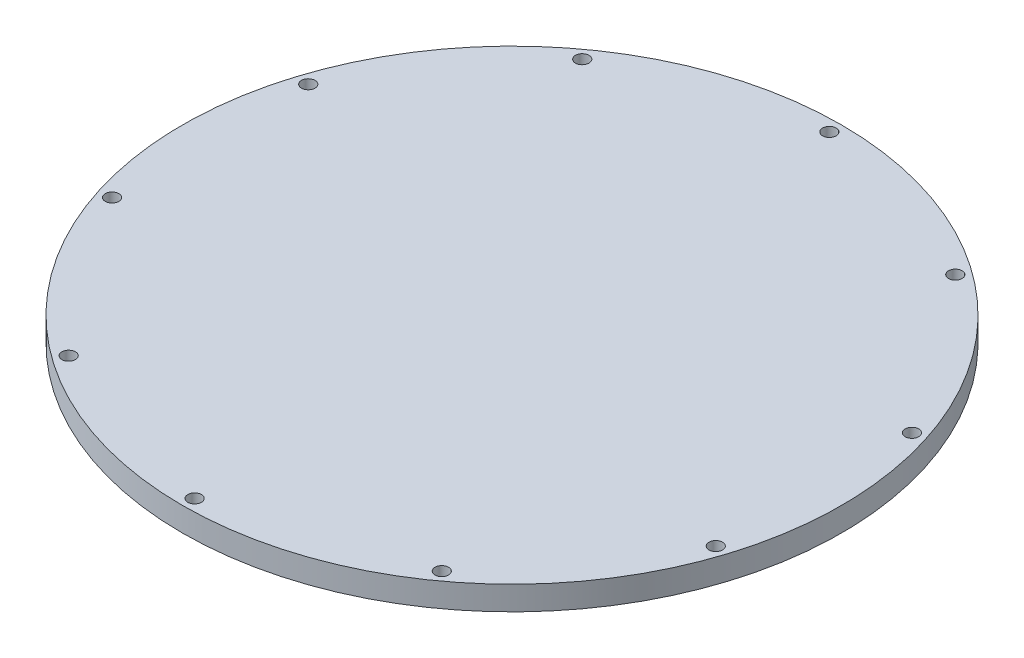
ISO-10303-21;
HEADER;
FILE_DESCRIPTION(('STEP AP214'),'2;1');
FILE_NAME('part.step','',(''),(''),'','','');
FILE_SCHEMA(('AUTOMOTIVE_DESIGN { 1 0 10303 214 1 1 1 1 }'));
ENDSEC;
DATA;
#1=APPLICATION_CONTEXT('core data for automotive mechanical design processes');
#2=APPLICATION_PROTOCOL_DEFINITION('international standard','automotive_design',2000,#1);
#3=PRODUCT_CONTEXT('',#1,'mechanical');
#4=PRODUCT('Part','Part','',(#3));
#5=PRODUCT_RELATED_PRODUCT_CATEGORY('part','',(#4));
#6=PRODUCT_DEFINITION_FORMATION('','',#4);
#7=PRODUCT_DEFINITION_CONTEXT('part definition',#1,'design');
#8=PRODUCT_DEFINITION('design','',#6,#7);
#9=PRODUCT_DEFINITION_SHAPE('','',#8);
#10=(LENGTH_UNIT() NAMED_UNIT(*) SI_UNIT(.MILLI.,.METRE.));
#11=(NAMED_UNIT(*) PLANE_ANGLE_UNIT() SI_UNIT($,.RADIAN.));
#12=(NAMED_UNIT(*) SI_UNIT($,.STERADIAN.) SOLID_ANGLE_UNIT());
#13=UNCERTAINTY_MEASURE_WITH_UNIT(LENGTH_MEASURE(1.E-05),#10,'distance_accuracy_value','');
#14=(GEOMETRIC_REPRESENTATION_CONTEXT(3) GLOBAL_UNCERTAINTY_ASSIGNED_CONTEXT((#13)) GLOBAL_UNIT_ASSIGNED_CONTEXT((#10,
#11,#12)) REPRESENTATION_CONTEXT('',''));
#15=CARTESIAN_POINT('',(0.,0.,0.));
#16=DIRECTION('',(0.,0.,1.));
#17=DIRECTION('',(1.,0.,0.));
#18=AXIS2_PLACEMENT_3D('',#15,#16,#17);
#19=CARTESIAN_POINT('',(0.,3.,0.));
#20=DIRECTION('',(0.,-1.,0.));
#21=DIRECTION('',(0.,0.,-1.));
#22=AXIS2_PLACEMENT_3D('',#19,#20,#21);
#23=CYLINDRICAL_SURFACE('',#22,82.55);
#24=CARTESIAN_POINT('',(0.,3.,0.));
#25=DIRECTION('',(0.,1.,0.));
#26=DIRECTION('',(0.,0.,1.));
#27=AXIS2_PLACEMENT_3D('',#24,#25,#26);
#28=CIRCLE('',#27,82.55);
#29=CARTESIAN_POINT('',(0.,3.,82.55));
#30=VERTEX_POINT('',#29);
#31=EDGE_CURVE('E10',#30,#30,#28,.T.);
#32=ORIENTED_EDGE('',*,*,#31,.F.);
#33=EDGE_LOOP('',(#32));
#34=FACE_BOUND('',#33,.T.);
#35=CARTESIAN_POINT('',(0.,-3.,0.));
#36=DIRECTION('',(0.,1.,0.));
#37=DIRECTION('',(0.,0.,1.));
#38=AXIS2_PLACEMENT_3D('',#35,#36,#37);
#39=CIRCLE('',#38,82.55);
#40=CARTESIAN_POINT('',(0.,-3.,82.55));
#41=VERTEX_POINT('',#40);
#42=EDGE_CURVE('E34',#41,#41,#39,.T.);
#43=ORIENTED_EDGE('',*,*,#42,.T.);
#44=EDGE_LOOP('',(#43));
#45=FACE_BOUND('',#44,.T.);
#46=ADVANCED_FACE('F31',(#34,#45),#23,.T.);
#47=CARTESIAN_POINT('',(0.,3.,0.));
#48=DIRECTION('',(0.,1.,0.));
#49=DIRECTION('',(0.,0.,1.));
#50=AXIS2_PLACEMENT_3D('',#47,#48,#49);
#51=PLANE('',#50);
#52=CARTESIAN_POINT('',(0.,3.,-79.5));
#53=DIRECTION('',(0.,1.,0.));
#54=DIRECTION('',(0.,0.,1.));
#55=AXIS2_PLACEMENT_3D('',#52,#53,#54);
#56=CIRCLE('',#55,1.7);
#57=CARTESIAN_POINT('',(0.,3.,-77.8));
#58=VERTEX_POINT('',#57);
#59=EDGE_CURVE('E99',#58,#58,#56,.T.);
#60=ORIENTED_EDGE('',*,*,#59,.F.);
#61=EDGE_LOOP('',(#60));
#62=FACE_BOUND('',#61,.T.);
#63=CARTESIAN_POINT('',(46.728927557252,3.,-64.3168510528081));
#64=DIRECTION('',(0.,1.,0.));
#65=DIRECTION('',(0.,0.,1.));
#66=AXIS2_PLACEMENT_3D('',#63,#64,#65);
#67=CIRCLE('',#66,1.7);
#68=CARTESIAN_POINT('',(46.728927557252,3.,-62.6168510528081));
#69=VERTEX_POINT('',#68);
#70=EDGE_CURVE('E93',#69,#69,#67,.T.);
#71=ORIENTED_EDGE('',*,*,#70,.F.);
#72=EDGE_LOOP('',(#71));
#73=FACE_BOUND('',#72,.T.);
#74=CARTESIAN_POINT('',(75.608993045465,3.,-24.5668510528075));
#75=DIRECTION('',(0.,1.,0.));
#76=DIRECTION('',(0.,0.,1.));
#77=AXIS2_PLACEMENT_3D('',#74,#75,#76);
#78=CIRCLE('',#77,1.69999999999999);
#79=CARTESIAN_POINT('',(75.608993045465,3.,-22.8668510528075));
#80=VERTEX_POINT('',#79);
#81=EDGE_CURVE('E87',#80,#80,#78,.T.);
#82=ORIENTED_EDGE('',*,*,#81,.F.);
#83=EDGE_LOOP('',(#82));
#84=FACE_BOUND('',#83,.T.);
#85=CARTESIAN_POINT('',(75.6089930454643,3.,24.5668510528096));
#86=DIRECTION('',(0.,1.,0.));
#87=DIRECTION('',(0.,0.,1.));
#88=AXIS2_PLACEMENT_3D('',#85,#86,#87);
#89=CIRCLE('',#88,1.69999999999999);
#90=CARTESIAN_POINT('',(75.6089930454643,3.,26.2668510528096));
#91=VERTEX_POINT('',#90);
#92=EDGE_CURVE('E81',#91,#91,#89,.T.);
#93=ORIENTED_EDGE('',*,*,#92,.F.);
#94=EDGE_LOOP('',(#93));
#95=FACE_BOUND('',#94,.T.);
#96=CARTESIAN_POINT('',(46.7289275572502,3.,64.3168510528094));
#97=DIRECTION('',(0.,1.,0.));
#98=DIRECTION('',(0.,0.,1.));
#99=AXIS2_PLACEMENT_3D('',#96,#97,#98);
#100=CIRCLE('',#99,1.7);
#101=CARTESIAN_POINT('',(46.7289275572502,3.,66.0168510528094));
#102=VERTEX_POINT('',#101);
#103=EDGE_CURVE('E75',#102,#102,#100,.T.);
#104=ORIENTED_EDGE('',*,*,#103,.F.);
#105=EDGE_LOOP('',(#104));
#106=FACE_BOUND('',#105,.T.);
#107=CARTESIAN_POINT('',(0.,3.,79.5));
#108=DIRECTION('',(0.,1.,0.));
#109=DIRECTION('',(0.,0.,1.));
#110=AXIS2_PLACEMENT_3D('',#107,#108,#109);
#111=CIRCLE('',#110,1.7);
#112=CARTESIAN_POINT('',(0.,3.,81.2));
#113=VERTEX_POINT('',#112);
#114=EDGE_CURVE('E69',#113,#113,#111,.T.);
#115=ORIENTED_EDGE('',*,*,#114,.F.);
#116=EDGE_LOOP('',(#115));
#117=FACE_BOUND('',#116,.T.);
#118=CARTESIAN_POINT('',(-46.7289275572516,3.,64.3168510528083));
#119=DIRECTION('',(0.,1.,0.));
#120=DIRECTION('',(0.,0.,1.));
#121=AXIS2_PLACEMENT_3D('',#118,#119,#120);
#122=CIRCLE('',#121,1.7);
#123=CARTESIAN_POINT('',(-46.7289275572516,3.,66.0168510528084));
#124=VERTEX_POINT('',#123);
#125=EDGE_CURVE('E63',#124,#124,#122,.T.);
#126=ORIENTED_EDGE('',*,*,#125,.F.);
#127=EDGE_LOOP('',(#126));
#128=FACE_BOUND('',#127,.T.);
#129=CARTESIAN_POINT('',(-75.6089930454647,3.,24.5668510528083));
#130=DIRECTION('',(0.,1.,0.));
#131=DIRECTION('',(0.,0.,1.));
#132=AXIS2_PLACEMENT_3D('',#129,#130,#131);
#133=CIRCLE('',#132,1.69999999999999);
#134=CARTESIAN_POINT('',(-75.6089930454647,3.,26.2668510528083));
#135=VERTEX_POINT('',#134);
#136=EDGE_CURVE('E57',#135,#135,#133,.T.);
#137=ORIENTED_EDGE('',*,*,#136,.F.);
#138=EDGE_LOOP('',(#137));
#139=FACE_BOUND('',#138,.T.);
#140=CARTESIAN_POINT('',(-75.6089930454647,3.,-24.5668510528083));
#141=DIRECTION('',(0.,1.,0.));
#142=DIRECTION('',(0.,0.,1.));
#143=AXIS2_PLACEMENT_3D('',#140,#141,#142);
#144=CIRCLE('',#143,1.69999999999999);
#145=CARTESIAN_POINT('',(-75.6089930454647,3.,-22.8668510528083));
#146=VERTEX_POINT('',#145);
#147=EDGE_CURVE('E51',#146,#146,#144,.T.);
#148=ORIENTED_EDGE('',*,*,#147,.F.);
#149=EDGE_LOOP('',(#148));
#150=FACE_BOUND('',#149,.T.);
#151=CARTESIAN_POINT('',(-46.7289275572516,3.,-64.3168510528083));
#152=DIRECTION('',(0.,1.,0.));
#153=DIRECTION('',(0.,0.,1.));
#154=AXIS2_PLACEMENT_3D('',#151,#152,#153);
#155=CIRCLE('',#154,1.7);
#156=CARTESIAN_POINT('',(-46.7289275572516,3.,-62.6168510528083));
#157=VERTEX_POINT('',#156);
#158=EDGE_CURVE('E45',#157,#157,#155,.T.);
#159=ORIENTED_EDGE('',*,*,#158,.F.);
#160=EDGE_LOOP('',(#159));
#161=FACE_BOUND('',#160,.T.);
#162=ORIENTED_EDGE('',*,*,#31,.T.);
#163=EDGE_LOOP('',(#162));
#164=FACE_BOUND('',#163,.T.);
#165=ADVANCED_FACE('F105',(#62,#73,#84,#95,#106,#117,#128,#139,#150,#161,#164),#51,.T.);
#166=CARTESIAN_POINT('',(0.,-3.,0.));
#167=DIRECTION('',(0.,1.,0.));
#168=DIRECTION('',(0.,0.,1.));
#169=AXIS2_PLACEMENT_3D('',#166,#167,#168);
#170=PLANE('',#169);
#171=CARTESIAN_POINT('',(0.,-3.,-79.5));
#172=DIRECTION('',(0.,1.,0.));
#173=DIRECTION('',(0.,0.,1.));
#174=AXIS2_PLACEMENT_3D('',#171,#172,#173);
#175=CIRCLE('',#174,1.7);
#176=CARTESIAN_POINT('',(0.,-3.,-77.8));
#177=VERTEX_POINT('',#176);
#178=EDGE_CURVE('E96',#177,#177,#175,.T.);
#179=ORIENTED_EDGE('',*,*,#178,.T.);
#180=EDGE_LOOP('',(#179));
#181=FACE_BOUND('',#180,.T.);
#182=CARTESIAN_POINT('',(46.728927557252,-3.,-64.3168510528081));
#183=DIRECTION('',(0.,1.,0.));
#184=DIRECTION('',(0.,0.,1.));
#185=AXIS2_PLACEMENT_3D('',#182,#183,#184);
#186=CIRCLE('',#185,1.7);
#187=CARTESIAN_POINT('',(46.728927557252,-3.,-62.6168510528081));
#188=VERTEX_POINT('',#187);
#189=EDGE_CURVE('E90',#188,#188,#186,.T.);
#190=ORIENTED_EDGE('',*,*,#189,.T.);
#191=EDGE_LOOP('',(#190));
#192=FACE_BOUND('',#191,.T.);
#193=CARTESIAN_POINT('',(75.608993045465,-3.,-24.5668510528075));
#194=DIRECTION('',(0.,1.,0.));
#195=DIRECTION('',(0.,0.,1.));
#196=AXIS2_PLACEMENT_3D('',#193,#194,#195);
#197=CIRCLE('',#196,1.69999999999999);
#198=CARTESIAN_POINT('',(75.608993045465,-3.,-22.8668510528075));
#199=VERTEX_POINT('',#198);
#200=EDGE_CURVE('E84',#199,#199,#197,.T.);
#201=ORIENTED_EDGE('',*,*,#200,.T.);
#202=EDGE_LOOP('',(#201));
#203=FACE_BOUND('',#202,.T.);
#204=CARTESIAN_POINT('',(75.6089930454643,-3.,24.5668510528096));
#205=DIRECTION('',(0.,1.,0.));
#206=DIRECTION('',(0.,0.,1.));
#207=AXIS2_PLACEMENT_3D('',#204,#205,#206);
#208=CIRCLE('',#207,1.69999999999999);
#209=CARTESIAN_POINT('',(75.6089930454643,-3.,26.2668510528096));
#210=VERTEX_POINT('',#209);
#211=EDGE_CURVE('E78',#210,#210,#208,.T.);
#212=ORIENTED_EDGE('',*,*,#211,.T.);
#213=EDGE_LOOP('',(#212));
#214=FACE_BOUND('',#213,.T.);
#215=CARTESIAN_POINT('',(46.7289275572502,-3.,64.3168510528094));
#216=DIRECTION('',(0.,1.,0.));
#217=DIRECTION('',(0.,0.,1.));
#218=AXIS2_PLACEMENT_3D('',#215,#216,#217);
#219=CIRCLE('',#218,1.7);
#220=CARTESIAN_POINT('',(46.7289275572502,-3.,66.0168510528094));
#221=VERTEX_POINT('',#220);
#222=EDGE_CURVE('E72',#221,#221,#219,.T.);
#223=ORIENTED_EDGE('',*,*,#222,.T.);
#224=EDGE_LOOP('',(#223));
#225=FACE_BOUND('',#224,.T.);
#226=CARTESIAN_POINT('',(0.,-3.,79.5));
#227=DIRECTION('',(0.,1.,0.));
#228=DIRECTION('',(0.,0.,1.));
#229=AXIS2_PLACEMENT_3D('',#226,#227,#228);
#230=CIRCLE('',#229,1.7);
#231=CARTESIAN_POINT('',(0.,-3.,81.2));
#232=VERTEX_POINT('',#231);
#233=EDGE_CURVE('E66',#232,#232,#230,.T.);
#234=ORIENTED_EDGE('',*,*,#233,.T.);
#235=EDGE_LOOP('',(#234));
#236=FACE_BOUND('',#235,.T.);
#237=CARTESIAN_POINT('',(-46.7289275572516,-3.,64.3168510528083));
#238=DIRECTION('',(0.,1.,0.));
#239=DIRECTION('',(0.,0.,1.));
#240=AXIS2_PLACEMENT_3D('',#237,#238,#239);
#241=CIRCLE('',#240,1.7);
#242=CARTESIAN_POINT('',(-46.7289275572516,-3.,66.0168510528084));
#243=VERTEX_POINT('',#242);
#244=EDGE_CURVE('E60',#243,#243,#241,.T.);
#245=ORIENTED_EDGE('',*,*,#244,.T.);
#246=EDGE_LOOP('',(#245));
#247=FACE_BOUND('',#246,.T.);
#248=CARTESIAN_POINT('',(-75.6089930454647,-3.,24.5668510528083));
#249=DIRECTION('',(0.,1.,0.));
#250=DIRECTION('',(0.,0.,1.));
#251=AXIS2_PLACEMENT_3D('',#248,#249,#250);
#252=CIRCLE('',#251,1.69999999999999);
#253=CARTESIAN_POINT('',(-75.6089930454647,-3.,26.2668510528083));
#254=VERTEX_POINT('',#253);
#255=EDGE_CURVE('E54',#254,#254,#252,.T.);
#256=ORIENTED_EDGE('',*,*,#255,.T.);
#257=EDGE_LOOP('',(#256));
#258=FACE_BOUND('',#257,.T.);
#259=CARTESIAN_POINT('',(-75.6089930454647,-3.,-24.5668510528083));
#260=DIRECTION('',(0.,1.,0.));
#261=DIRECTION('',(0.,0.,1.));
#262=AXIS2_PLACEMENT_3D('',#259,#260,#261);
#263=CIRCLE('',#262,1.69999999999999);
#264=CARTESIAN_POINT('',(-75.6089930454647,-3.,-22.8668510528083));
#265=VERTEX_POINT('',#264);
#266=EDGE_CURVE('E48',#265,#265,#263,.T.);
#267=ORIENTED_EDGE('',*,*,#266,.T.);
#268=EDGE_LOOP('',(#267));
#269=FACE_BOUND('',#268,.T.);
#270=CARTESIAN_POINT('',(-46.7289275572516,-3.,-64.3168510528083));
#271=DIRECTION('',(0.,1.,0.));
#272=DIRECTION('',(0.,0.,1.));
#273=AXIS2_PLACEMENT_3D('',#270,#271,#272);
#274=CIRCLE('',#273,1.7);
#275=CARTESIAN_POINT('',(-46.7289275572516,-3.,-62.6168510528083));
#276=VERTEX_POINT('',#275);
#277=EDGE_CURVE('E41',#276,#276,#274,.T.);
#278=ORIENTED_EDGE('',*,*,#277,.T.);
#279=EDGE_LOOP('',(#278));
#280=FACE_BOUND('',#279,.T.);
#281=ORIENTED_EDGE('',*,*,#42,.F.);
#282=EDGE_LOOP('',(#281));
#283=FACE_BOUND('',#282,.T.);
#284=ADVANCED_FACE('F108',(#181,#192,#203,#214,#225,#236,#247,#258,#269,#280,#283),#170,.F.);
#285=CARTESIAN_POINT('',(-46.7289275572516,3.,-64.3168510528083));
#286=DIRECTION('',(0.,1.,0.));
#287=DIRECTION('',(0.,0.,1.));
#288=AXIS2_PLACEMENT_3D('',#285,#286,#287);
#289=CYLINDRICAL_SURFACE('',#288,1.7);
#290=ORIENTED_EDGE('',*,*,#277,.F.);
#291=EDGE_LOOP('',(#290));
#292=FACE_BOUND('',#291,.T.);
#293=ORIENTED_EDGE('',*,*,#158,.T.);
#294=EDGE_LOOP('',(#293));
#295=FACE_BOUND('',#294,.T.);
#296=ADVANCED_FACE('F128',(#292,#295),#289,.F.);
#297=CARTESIAN_POINT('',(-75.6089930454647,3.,-24.5668510528083));
#298=DIRECTION('',(0.,1.,0.));
#299=DIRECTION('',(0.,0.,1.));
#300=AXIS2_PLACEMENT_3D('',#297,#298,#299);
#301=CYLINDRICAL_SURFACE('',#300,1.69999999999999);
#302=ORIENTED_EDGE('',*,*,#266,.F.);
#303=EDGE_LOOP('',(#302));
#304=FACE_BOUND('',#303,.T.);
#305=ORIENTED_EDGE('',*,*,#147,.T.);
#306=EDGE_LOOP('',(#305));
#307=FACE_BOUND('',#306,.T.);
#308=ADVANCED_FACE('F130',(#304,#307),#301,.F.);
#309=CARTESIAN_POINT('',(-75.6089930454647,3.,24.5668510528083));
#310=DIRECTION('',(0.,1.,0.));
#311=DIRECTION('',(0.,0.,1.));
#312=AXIS2_PLACEMENT_3D('',#309,#310,#311);
#313=CYLINDRICAL_SURFACE('',#312,1.69999999999999);
#314=ORIENTED_EDGE('',*,*,#255,.F.);
#315=EDGE_LOOP('',(#314));
#316=FACE_BOUND('',#315,.T.);
#317=ORIENTED_EDGE('',*,*,#136,.T.);
#318=EDGE_LOOP('',(#317));
#319=FACE_BOUND('',#318,.T.);
#320=ADVANCED_FACE('F137',(#316,#319),#313,.F.);
#321=CARTESIAN_POINT('',(-46.7289275572516,3.,64.3168510528083));
#322=DIRECTION('',(0.,1.,0.));
#323=DIRECTION('',(0.,0.,1.));
#324=AXIS2_PLACEMENT_3D('',#321,#322,#323);
#325=CYLINDRICAL_SURFACE('',#324,1.7);
#326=ORIENTED_EDGE('',*,*,#244,.F.);
#327=EDGE_LOOP('',(#326));
#328=FACE_BOUND('',#327,.T.);
#329=ORIENTED_EDGE('',*,*,#125,.T.);
#330=EDGE_LOOP('',(#329));
#331=FACE_BOUND('',#330,.T.);
#332=ADVANCED_FACE('F176',(#328,#331),#325,.F.);
#333=CARTESIAN_POINT('',(0.,3.,79.5));
#334=DIRECTION('',(0.,1.,0.));
#335=DIRECTION('',(0.,0.,1.));
#336=AXIS2_PLACEMENT_3D('',#333,#334,#335);
#337=CYLINDRICAL_SURFACE('',#336,1.7);
#338=ORIENTED_EDGE('',*,*,#233,.F.);
#339=EDGE_LOOP('',(#338));
#340=FACE_BOUND('',#339,.T.);
#341=ORIENTED_EDGE('',*,*,#114,.T.);
#342=EDGE_LOOP('',(#341));
#343=FACE_BOUND('',#342,.T.);
#344=ADVANCED_FACE('F186',(#340,#343),#337,.F.);
#345=CARTESIAN_POINT('',(46.7289275572502,3.,64.3168510528094));
#346=DIRECTION('',(0.,1.,0.));
#347=DIRECTION('',(0.,0.,1.));
#348=AXIS2_PLACEMENT_3D('',#345,#346,#347);
#349=CYLINDRICAL_SURFACE('',#348,1.7);
#350=ORIENTED_EDGE('',*,*,#222,.F.);
#351=EDGE_LOOP('',(#350));
#352=FACE_BOUND('',#351,.T.);
#353=ORIENTED_EDGE('',*,*,#103,.T.);
#354=EDGE_LOOP('',(#353));
#355=FACE_BOUND('',#354,.T.);
#356=ADVANCED_FACE('F196',(#352,#355),#349,.F.);
#357=CARTESIAN_POINT('',(75.6089930454643,3.,24.5668510528096));
#358=DIRECTION('',(0.,1.,0.));
#359=DIRECTION('',(0.,0.,1.));
#360=AXIS2_PLACEMENT_3D('',#357,#358,#359);
#361=CYLINDRICAL_SURFACE('',#360,1.69999999999999);
#362=ORIENTED_EDGE('',*,*,#211,.F.);
#363=EDGE_LOOP('',(#362));
#364=FACE_BOUND('',#363,.T.);
#365=ORIENTED_EDGE('',*,*,#92,.T.);
#366=EDGE_LOOP('',(#365));
#367=FACE_BOUND('',#366,.T.);
#368=ADVANCED_FACE('F206',(#364,#367),#361,.F.);
#369=CARTESIAN_POINT('',(75.608993045465,3.,-24.5668510528075));
#370=DIRECTION('',(0.,1.,0.));
#371=DIRECTION('',(0.,0.,1.));
#372=AXIS2_PLACEMENT_3D('',#369,#370,#371);
#373=CYLINDRICAL_SURFACE('',#372,1.69999999999999);
#374=ORIENTED_EDGE('',*,*,#200,.F.);
#375=EDGE_LOOP('',(#374));
#376=FACE_BOUND('',#375,.T.);
#377=ORIENTED_EDGE('',*,*,#81,.T.);
#378=EDGE_LOOP('',(#377));
#379=FACE_BOUND('',#378,.T.);
#380=ADVANCED_FACE('F216',(#376,#379),#373,.F.);
#381=CARTESIAN_POINT('',(46.728927557252,3.,-64.3168510528081));
#382=DIRECTION('',(0.,1.,0.));
#383=DIRECTION('',(0.,0.,1.));
#384=AXIS2_PLACEMENT_3D('',#381,#382,#383);
#385=CYLINDRICAL_SURFACE('',#384,1.7);
#386=ORIENTED_EDGE('',*,*,#189,.F.);
#387=EDGE_LOOP('',(#386));
#388=FACE_BOUND('',#387,.T.);
#389=ORIENTED_EDGE('',*,*,#70,.T.);
#390=EDGE_LOOP('',(#389));
#391=FACE_BOUND('',#390,.T.);
#392=ADVANCED_FACE('F226',(#388,#391),#385,.F.);
#393=CARTESIAN_POINT('',(0.,3.,-79.5));
#394=DIRECTION('',(0.,1.,0.));
#395=DIRECTION('',(0.,0.,1.));
#396=AXIS2_PLACEMENT_3D('',#393,#394,#395);
#397=CYLINDRICAL_SURFACE('',#396,1.7);
#398=ORIENTED_EDGE('',*,*,#178,.F.);
#399=EDGE_LOOP('',(#398));
#400=FACE_BOUND('',#399,.T.);
#401=ORIENTED_EDGE('',*,*,#59,.T.);
#402=EDGE_LOOP('',(#401));
#403=FACE_BOUND('',#402,.T.);
#404=ADVANCED_FACE('F103',(#400,#403),#397,.F.);
#405=CLOSED_SHELL('',(#46,#165,#284,#296,#308,#320,#332,#344,#356,#368,#380,#392,#404));
#406=MANIFOLD_SOLID_BREP('B2',#405);
#407=ADVANCED_BREP_SHAPE_REPRESENTATION('',(#18,#406),#14);
#408=SHAPE_DEFINITION_REPRESENTATION(#9,#407);
ENDSEC;
END-ISO-10303-21;
